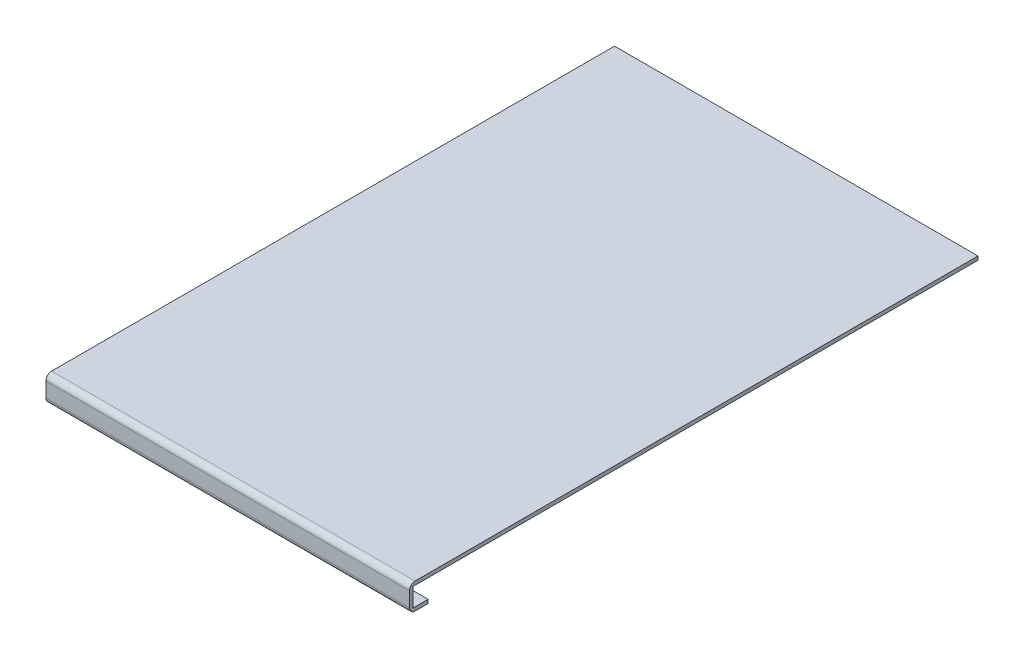
ISO-10303-21;
HEADER;
FILE_DESCRIPTION(('STEP AP214'),'2;1');
FILE_NAME('part.step','',(''),(''),'','','');
FILE_SCHEMA(('AUTOMOTIVE_DESIGN { 1 0 10303 214 1 1 1 1 }'));
ENDSEC;
DATA;
#1=APPLICATION_CONTEXT('core data for automotive mechanical design processes');
#2=APPLICATION_PROTOCOL_DEFINITION('international standard','automotive_design',2000,#1);
#3=PRODUCT_CONTEXT('',#1,'mechanical');
#4=PRODUCT('Part','Part','',(#3));
#5=PRODUCT_RELATED_PRODUCT_CATEGORY('part','',(#4));
#6=PRODUCT_DEFINITION_FORMATION('','',#4);
#7=PRODUCT_DEFINITION_CONTEXT('part definition',#1,'design');
#8=PRODUCT_DEFINITION('design','',#6,#7);
#9=PRODUCT_DEFINITION_SHAPE('','',#8);
#10=(LENGTH_UNIT() NAMED_UNIT(*) SI_UNIT(.MILLI.,.METRE.));
#11=(NAMED_UNIT(*) PLANE_ANGLE_UNIT() SI_UNIT($,.RADIAN.));
#12=(NAMED_UNIT(*) SI_UNIT($,.STERADIAN.) SOLID_ANGLE_UNIT());
#13=UNCERTAINTY_MEASURE_WITH_UNIT(LENGTH_MEASURE(1.E-05),#10,'distance_accuracy_value','');
#14=(GEOMETRIC_REPRESENTATION_CONTEXT(3) GLOBAL_UNCERTAINTY_ASSIGNED_CONTEXT((#13)) GLOBAL_UNIT_ASSIGNED_CONTEXT((#10,
#11,#12)) REPRESENTATION_CONTEXT('',''));
#15=CARTESIAN_POINT('',(0.,0.,0.));
#16=DIRECTION('',(0.,0.,1.));
#17=DIRECTION('',(1.,0.,0.));
#18=AXIS2_PLACEMENT_3D('',#15,#16,#17);
#19=CARTESIAN_POINT('',(157.5,0.,-153.));
#20=DIRECTION('',(0.768221279597377,-0.640184399664479,0.));
#21=DIRECTION('',(0.640184399664479,0.768221279597377,0.));
#22=AXIS2_PLACEMENT_3D('',#19,#20,#21);
#23=PLANE('',#22);
#24=DIRECTION('',(-0.640184399664479,-0.768221279597377,0.));
#25=VECTOR('',#24,1.);
#26=CARTESIAN_POINT('',(157.5,0.,-155.));
#27=LINE('',#26,#25);
#28=CARTESIAN_POINT('',(157.5,0.,-155.));
#29=VERTEX_POINT('',#28);
#30=CARTESIAN_POINT('',(147.5,-12.,-155.));
#31=VERTEX_POINT('',#30);
#32=EDGE_CURVE('E107',#29,#31,#27,.T.);
#33=ORIENTED_EDGE('',*,*,#32,.F.);
#34=DIRECTION('',(0.,0.,-1.));
#35=VECTOR('',#34,1.);
#36=CARTESIAN_POINT('',(157.5,0.,-153.));
#37=LINE('',#36,#35);
#38=CARTESIAN_POINT('',(157.5,0.,-153.));
#39=VERTEX_POINT('',#38);
#40=EDGE_CURVE('E12',#39,#29,#37,.T.);
#41=ORIENTED_EDGE('',*,*,#40,.F.);
#42=DIRECTION('',(-0.640184399664479,-0.768221279597377,0.));
#43=VECTOR('',#42,1.);
#44=CARTESIAN_POINT('',(157.5,0.,-153.));
#45=LINE('',#44,#43);
#46=CARTESIAN_POINT('',(147.5,-12.,-153.));
#47=VERTEX_POINT('',#46);
#48=EDGE_CURVE('E101',#39,#47,#45,.T.);
#49=ORIENTED_EDGE('',*,*,#48,.T.);
#50=DIRECTION('',(0.,0.,-1.));
#51=VECTOR('',#50,1.);
#52=CARTESIAN_POINT('',(147.5,-12.,-153.));
#53=LINE('',#52,#51);
#54=EDGE_CURVE('E46',#47,#31,#53,.T.);
#55=ORIENTED_EDGE('',*,*,#54,.T.);
#56=EDGE_LOOP('',(#33,#41,#49,#55));
#57=FACE_BOUND('',#56,.T.);
#58=ADVANCED_FACE('F43',(#57),#23,.T.);
#59=CARTESIAN_POINT('',(37.5,0.,-153.));
#60=DIRECTION('',(0.,1.,0.));
#61=DIRECTION('',(0.,0.,1.));
#62=AXIS2_PLACEMENT_3D('',#59,#60,#61);
#63=PLANE('',#62);
#64=DIRECTION('',(1.,0.,0.));
#65=VECTOR('',#64,1.);
#66=CARTESIAN_POINT('',(37.5,0.,-155.));
#67=LINE('',#66,#65);
#68=CARTESIAN_POINT('',(37.5,0.,-155.));
#69=VERTEX_POINT('',#68);
#70=EDGE_CURVE('E103',#69,#29,#67,.T.);
#71=ORIENTED_EDGE('',*,*,#70,.F.);
#72=DIRECTION('',(0.,0.,-1.));
#73=VECTOR('',#72,1.);
#74=CARTESIAN_POINT('',(37.5,0.,-153.));
#75=LINE('',#74,#73);
#76=CARTESIAN_POINT('',(37.5,0.,-153.));
#77=VERTEX_POINT('',#76);
#78=EDGE_CURVE('E52',#77,#69,#75,.T.);
#79=ORIENTED_EDGE('',*,*,#78,.F.);
#80=DIRECTION('',(1.,0.,0.));
#81=VECTOR('',#80,1.);
#82=CARTESIAN_POINT('',(37.5,0.,-153.));
#83=LINE('',#82,#81);
#84=EDGE_CURVE('E98',#77,#39,#83,.T.);
#85=ORIENTED_EDGE('',*,*,#84,.T.);
#86=ORIENTED_EDGE('',*,*,#40,.T.);
#87=EDGE_LOOP('',(#71,#79,#85,#86));
#88=FACE_BOUND('',#87,.T.);
#89=ADVANCED_FACE('F117',(#88),#63,.T.);
#90=CARTESIAN_POINT('',(37.5,0.,-153.));
#91=DIRECTION('',(-0.768221279597377,-0.640184399664479,0.));
#92=DIRECTION('',(0.640184399664479,-0.768221279597377,0.));
#93=AXIS2_PLACEMENT_3D('',#90,#91,#92);
#94=PLANE('',#93);
#95=DIRECTION('',(-0.640184399664479,0.768221279597377,0.));
#96=VECTOR('',#95,1.);
#97=CARTESIAN_POINT('',(37.5,0.,-155.));
#98=LINE('',#97,#96);
#99=CARTESIAN_POINT('',(47.5,-12.,-155.));
#100=VERTEX_POINT('',#99);
#101=EDGE_CURVE('E93',#100,#69,#98,.T.);
#102=ORIENTED_EDGE('',*,*,#101,.F.);
#103=DIRECTION('',(0.,0.,-1.));
#104=VECTOR('',#103,1.);
#105=CARTESIAN_POINT('',(47.5,-12.,-153.));
#106=LINE('',#105,#104);
#107=CARTESIAN_POINT('',(47.5,-12.,-153.));
#108=VERTEX_POINT('',#107);
#109=EDGE_CURVE('E88',#108,#100,#106,.T.);
#110=ORIENTED_EDGE('',*,*,#109,.F.);
#111=DIRECTION('',(-0.640184399664479,0.768221279597377,0.));
#112=VECTOR('',#111,1.);
#113=CARTESIAN_POINT('',(37.5,0.,-153.));
#114=LINE('',#113,#112);
#115=EDGE_CURVE('E91',#108,#77,#114,.T.);
#116=ORIENTED_EDGE('',*,*,#115,.T.);
#117=ORIENTED_EDGE('',*,*,#78,.T.);
#118=EDGE_LOOP('',(#102,#110,#116,#117));
#119=FACE_BOUND('',#118,.T.);
#120=ADVANCED_FACE('F90',(#119),#94,.T.);
#121=CARTESIAN_POINT('',(147.5,-12.,-153.));
#122=DIRECTION('',(0.,-1.,0.));
#123=DIRECTION('',(0.,0.,-1.));
#124=AXIS2_PLACEMENT_3D('',#121,#122,#123);
#125=PLANE('',#124);
#126=DIRECTION('',(-1.,0.,0.));
#127=VECTOR('',#126,1.);
#128=CARTESIAN_POINT('',(147.5,-12.,-155.));
#129=LINE('',#128,#127);
#130=EDGE_CURVE('E110',#31,#100,#129,.T.);
#131=ORIENTED_EDGE('',*,*,#130,.F.);
#132=ORIENTED_EDGE('',*,*,#54,.F.);
#133=DIRECTION('',(-1.,0.,0.));
#134=VECTOR('',#133,1.);
#135=CARTESIAN_POINT('',(147.5,-12.,-153.));
#136=LINE('',#135,#134);
#137=EDGE_CURVE('E97',#47,#108,#136,.T.);
#138=ORIENTED_EDGE('',*,*,#137,.T.);
#139=ORIENTED_EDGE('',*,*,#109,.T.);
#140=EDGE_LOOP('',(#131,#132,#138,#139));
#141=FACE_BOUND('',#140,.T.);
#142=ADVANCED_FACE('F100',(#141),#125,.T.);
#143=CARTESIAN_POINT('',(0.,0.,-153.));
#144=DIRECTION('',(0.,0.,1.));
#145=DIRECTION('',(1.,0.,0.));
#146=AXIS2_PLACEMENT_3D('',#143,#144,#145);
#147=PLANE('',#146);
#148=ORIENTED_EDGE('',*,*,#48,.F.);
#149=ORIENTED_EDGE('',*,*,#84,.F.);
#150=ORIENTED_EDGE('',*,*,#115,.F.);
#151=ORIENTED_EDGE('',*,*,#137,.F.);
#152=EDGE_LOOP('',(#148,#149,#150,#151));
#153=FACE_BOUND('',#152,.T.);
#154=ADVANCED_FACE('F96',(#153),#147,.T.);
#155=CARTESIAN_POINT('',(0.,0.,-155.));
#156=DIRECTION('',(0.,0.,1.));
#157=DIRECTION('',(1.,0.,0.));
#158=AXIS2_PLACEMENT_3D('',#155,#156,#157);
#159=PLANE('',#158);
#160=ORIENTED_EDGE('',*,*,#32,.T.);
#161=ORIENTED_EDGE('',*,*,#130,.T.);
#162=ORIENTED_EDGE('',*,*,#101,.T.);
#163=ORIENTED_EDGE('',*,*,#70,.T.);
#164=EDGE_LOOP('',(#160,#161,#162,#163));
#165=FACE_BOUND('',#164,.T.);
#166=ADVANCED_FACE('F116',(#165),#159,.F.);
#167=CLOSED_SHELL('',(#58,#89,#120,#142,#154,#166));
#168=MANIFOLD_SOLID_BREP('B2',#167);
#169=CARTESIAN_POINT('',(195.,0.,0.));
#170=DIRECTION('',(0.,-1.,0.));
#171=DIRECTION('',(0.,0.,-1.));
#172=AXIS2_PLACEMENT_3D('',#169,#170,#171);
#173=PLANE('',#172);
#174=DIRECTION('',(0.,0.,1.));
#175=VECTOR('',#174,1.);
#176=CARTESIAN_POINT('',(0.,0.,0.));
#177=LINE('',#176,#175);
#178=CARTESIAN_POINT('',(0.,0.,-155.));
#179=VERTEX_POINT('',#178);
#180=CARTESIAN_POINT('',(0.,0.,147.));
#181=VERTEX_POINT('',#180);
#182=EDGE_CURVE('E282',#179,#181,#177,.T.);
#183=ORIENTED_EDGE('',*,*,#182,.T.);
#184=DIRECTION('',(-1.,0.,0.));
#185=VECTOR('',#184,1.);
#186=CARTESIAN_POINT('',(195.,0.,147.));
#187=LINE('',#186,#185);
#188=CARTESIAN_POINT('',(195.,0.,147.));
#189=VERTEX_POINT('',#188);
#190=EDGE_CURVE('E41',#181,#189,#187,.F.);
#191=ORIENTED_EDGE('',*,*,#190,.T.);
#192=DIRECTION('',(0.,0.,1.));
#193=VECTOR('',#192,1.);
#194=CARTESIAN_POINT('',(195.,0.,0.));
#195=LINE('',#194,#193);
#196=CARTESIAN_POINT('',(195.,0.,-155.));
#197=VERTEX_POINT('',#196);
#198=EDGE_CURVE('E299',#197,#189,#195,.T.);
#199=ORIENTED_EDGE('',*,*,#198,.F.);
#200=DIRECTION('',(-1.,0.,0.));
#201=VECTOR('',#200,1.);
#202=CARTESIAN_POINT('',(195.,0.,-155.));
#203=LINE('',#202,#201);
#204=EDGE_CURVE('E281',#197,#179,#203,.T.);
#205=ORIENTED_EDGE('',*,*,#204,.T.);
#206=EDGE_LOOP('',(#183,#191,#199,#205));
#207=FACE_BOUND('',#206,.T.);
#208=ADVANCED_FACE('F167',(#207),#173,.F.);
#209=CARTESIAN_POINT('',(195.,0.,150.));
#210=DIRECTION('',(0.,0.,-1.));
#211=DIRECTION('',(-1.,0.,0.));
#212=AXIS2_PLACEMENT_3D('',#209,#210,#211);
#213=PLANE('',#212);
#214=DIRECTION('',(0.,-1.,0.));
#215=VECTOR('',#214,1.);
#216=CARTESIAN_POINT('',(0.,0.,150.));
#217=LINE('',#216,#215);
#218=CARTESIAN_POINT('',(0.,-3.00000000000002,150.));
#219=VERTEX_POINT('',#218);
#220=CARTESIAN_POINT('',(0.,-11.,150.));
#221=VERTEX_POINT('',#220);
#222=EDGE_CURVE('E284',#219,#221,#217,.T.);
#223=ORIENTED_EDGE('',*,*,#222,.T.);
#224=DIRECTION('',(-1.,0.,0.));
#225=VECTOR('',#224,1.);
#226=CARTESIAN_POINT('',(195.,-11.,150.));
#227=LINE('',#226,#225);
#228=CARTESIAN_POINT('',(195.,-11.,150.));
#229=VERTEX_POINT('',#228);
#230=EDGE_CURVE('E188',#221,#229,#227,.F.);
#231=ORIENTED_EDGE('',*,*,#230,.T.);
#232=DIRECTION('',(0.,-1.,0.));
#233=VECTOR('',#232,1.);
#234=CARTESIAN_POINT('',(195.,0.,150.));
#235=LINE('',#234,#233);
#236=CARTESIAN_POINT('',(195.,-3.00000000000002,150.));
#237=VERTEX_POINT('',#236);
#238=EDGE_CURVE('E255',#237,#229,#235,.T.);
#239=ORIENTED_EDGE('',*,*,#238,.F.);
#240=DIRECTION('',(-1.,0.,0.));
#241=VECTOR('',#240,1.);
#242=CARTESIAN_POINT('',(195.,-3.00000000000002,150.));
#243=LINE('',#242,#241);
#244=EDGE_CURVE('E317',#237,#219,#243,.T.);
#245=ORIENTED_EDGE('',*,*,#244,.T.);
#246=EDGE_LOOP('',(#223,#231,#239,#245));
#247=FACE_BOUND('',#246,.T.);
#248=ADVANCED_FACE('F325',(#247),#213,.F.);
#249=CARTESIAN_POINT('',(195.,-14.,150.));
#250=DIRECTION('',(0.,1.,0.));
#251=DIRECTION('',(0.,0.,1.));
#252=AXIS2_PLACEMENT_3D('',#249,#250,#251);
#253=PLANE('',#252);
#254=DIRECTION('',(0.,0.,-1.));
#255=VECTOR('',#254,1.);
#256=CARTESIAN_POINT('',(195.,-14.,150.));
#257=LINE('',#256,#255);
#258=CARTESIAN_POINT('',(195.,-14.,147.));
#259=VERTEX_POINT('',#258);
#260=CARTESIAN_POINT('',(195.,-14.,140.));
#261=VERTEX_POINT('',#260);
#262=EDGE_CURVE('E245',#259,#261,#257,.T.);
#263=ORIENTED_EDGE('',*,*,#262,.F.);
#264=DIRECTION('',(-1.,0.,0.));
#265=VECTOR('',#264,1.);
#266=CARTESIAN_POINT('',(195.,-14.,147.));
#267=LINE('',#266,#265);
#268=CARTESIAN_POINT('',(0.,-14.,147.));
#269=VERTEX_POINT('',#268);
#270=EDGE_CURVE('E264',#259,#269,#267,.T.);
#271=ORIENTED_EDGE('',*,*,#270,.T.);
#272=DIRECTION('',(0.,0.,-1.));
#273=VECTOR('',#272,1.);
#274=CARTESIAN_POINT('',(0.,-14.,150.));
#275=LINE('',#274,#273);
#276=CARTESIAN_POINT('',(0.,-14.,140.));
#277=VERTEX_POINT('',#276);
#278=EDGE_CURVE('E261',#269,#277,#275,.T.);
#279=ORIENTED_EDGE('',*,*,#278,.T.);
#280=DIRECTION('',(-1.,0.,0.));
#281=VECTOR('',#280,1.);
#282=CARTESIAN_POINT('',(195.,-14.,140.));
#283=LINE('',#282,#281);
#284=EDGE_CURVE('E258',#261,#277,#283,.T.);
#285=ORIENTED_EDGE('',*,*,#284,.F.);
#286=EDGE_LOOP('',(#263,#271,#279,#285));
#287=FACE_BOUND('',#286,.T.);
#288=ADVANCED_FACE('F259',(#287),#253,.F.);
#289=CARTESIAN_POINT('',(195.,-12.,140.));
#290=DIRECTION('',(0.,0.,1.));
#291=DIRECTION('',(1.,0.,0.));
#292=AXIS2_PLACEMENT_3D('',#289,#290,#291);
#293=PLANE('',#292);
#294=DIRECTION('',(0.,1.,0.));
#295=VECTOR('',#294,1.);
#296=CARTESIAN_POINT('',(0.,-12.,140.));
#297=LINE('',#296,#295);
#298=CARTESIAN_POINT('',(0.,-12.,140.));
#299=VERTEX_POINT('',#298);
#300=EDGE_CURVE('E287',#277,#299,#297,.T.);
#301=ORIENTED_EDGE('',*,*,#300,.T.);
#302=DIRECTION('',(-1.,0.,0.));
#303=VECTOR('',#302,1.);
#304=CARTESIAN_POINT('',(195.,-12.,140.));
#305=LINE('',#304,#303);
#306=CARTESIAN_POINT('',(195.,-12.,140.));
#307=VERTEX_POINT('',#306);
#308=EDGE_CURVE('E265',#307,#299,#305,.T.);
#309=ORIENTED_EDGE('',*,*,#308,.F.);
#310=DIRECTION('',(0.,1.,0.));
#311=VECTOR('',#310,1.);
#312=CARTESIAN_POINT('',(195.,-12.,140.));
#313=LINE('',#312,#311);
#314=EDGE_CURVE('E249',#261,#307,#313,.T.);
#315=ORIENTED_EDGE('',*,*,#314,.F.);
#316=ORIENTED_EDGE('',*,*,#284,.T.);
#317=EDGE_LOOP('',(#301,#309,#315,#316));
#318=FACE_BOUND('',#317,.T.);
#319=ADVANCED_FACE('F267',(#318),#293,.F.);
#320=CARTESIAN_POINT('',(195.,-12.,148.));
#321=DIRECTION('',(0.,-1.,0.));
#322=DIRECTION('',(0.,0.,-1.));
#323=AXIS2_PLACEMENT_3D('',#320,#321,#322);
#324=PLANE('',#323);
#325=DIRECTION('',(0.,0.,1.));
#326=VECTOR('',#325,1.);
#327=CARTESIAN_POINT('',(0.,-12.,148.));
#328=LINE('',#327,#326);
#329=CARTESIAN_POINT('',(0.,-12.,148.));
#330=VERTEX_POINT('',#329);
#331=EDGE_CURVE('E289',#299,#330,#328,.T.);
#332=ORIENTED_EDGE('',*,*,#331,.T.);
#333=DIRECTION('',(-1.,0.,0.));
#334=VECTOR('',#333,1.);
#335=CARTESIAN_POINT('',(195.,-12.,148.));
#336=LINE('',#335,#334);
#337=CARTESIAN_POINT('',(195.,-12.,148.));
#338=VERTEX_POINT('',#337);
#339=EDGE_CURVE('E308',#338,#330,#336,.T.);
#340=ORIENTED_EDGE('',*,*,#339,.F.);
#341=DIRECTION('',(0.,0.,1.));
#342=VECTOR('',#341,1.);
#343=CARTESIAN_POINT('',(195.,-12.,148.));
#344=LINE('',#343,#342);
#345=EDGE_CURVE('E270',#307,#338,#344,.T.);
#346=ORIENTED_EDGE('',*,*,#345,.F.);
#347=ORIENTED_EDGE('',*,*,#308,.T.);
#348=EDGE_LOOP('',(#332,#340,#346,#347));
#349=FACE_BOUND('',#348,.T.);
#350=ADVANCED_FACE('F346',(#349),#324,.F.);
#351=CARTESIAN_POINT('',(195.,-12.,148.));
#352=DIRECTION('',(0.,0.,1.));
#353=DIRECTION('',(1.,0.,0.));
#354=AXIS2_PLACEMENT_3D('',#351,#352,#353);
#355=PLANE('',#354);
#356=DIRECTION('',(0.,1.,0.));
#357=VECTOR('',#356,1.);
#358=CARTESIAN_POINT('',(0.,-12.,148.));
#359=LINE('',#358,#357);
#360=CARTESIAN_POINT('',(0.,-2.00000000000001,148.));
#361=VERTEX_POINT('',#360);
#362=EDGE_CURVE('E291',#330,#361,#359,.T.);
#363=ORIENTED_EDGE('',*,*,#362,.T.);
#364=DIRECTION('',(-1.,0.,0.));
#365=VECTOR('',#364,1.);
#366=CARTESIAN_POINT('',(195.,-2.00000000000001,148.));
#367=LINE('',#366,#365);
#368=CARTESIAN_POINT('',(195.,-2.00000000000001,148.));
#369=VERTEX_POINT('',#368);
#370=EDGE_CURVE('E305',#369,#361,#367,.T.);
#371=ORIENTED_EDGE('',*,*,#370,.F.);
#372=DIRECTION('',(0.,1.,0.));
#373=VECTOR('',#372,1.);
#374=CARTESIAN_POINT('',(195.,-12.,148.));
#375=LINE('',#374,#373);
#376=EDGE_CURVE('E272',#338,#369,#375,.T.);
#377=ORIENTED_EDGE('',*,*,#376,.F.);
#378=ORIENTED_EDGE('',*,*,#339,.T.);
#379=EDGE_LOOP('',(#363,#371,#377,#378));
#380=FACE_BOUND('',#379,.T.);
#381=ADVANCED_FACE('F340',(#380),#355,.F.);
#382=CARTESIAN_POINT('',(195.,-2.00000000000002,-155.));
#383=DIRECTION('',(0.,1.,0.));
#384=DIRECTION('',(0.,0.,1.));
#385=AXIS2_PLACEMENT_3D('',#382,#383,#384);
#386=PLANE('',#385);
#387=DIRECTION('',(0.,0.,-1.));
#388=VECTOR('',#387,1.);
#389=CARTESIAN_POINT('',(0.,-2.00000000000002,-155.));
#390=LINE('',#389,#388);
#391=CARTESIAN_POINT('',(0.,-2.00000000000002,-155.));
#392=VERTEX_POINT('',#391);
#393=EDGE_CURVE('E294',#361,#392,#390,.T.);
#394=ORIENTED_EDGE('',*,*,#393,.T.);
#395=DIRECTION('',(-1.,0.,0.));
#396=VECTOR('',#395,1.);
#397=CARTESIAN_POINT('',(195.,-2.00000000000002,-155.));
#398=LINE('',#397,#396);
#399=CARTESIAN_POINT('',(195.,-2.00000000000002,-155.));
#400=VERTEX_POINT('',#399);
#401=EDGE_CURVE('E302',#400,#392,#398,.T.);
#402=ORIENTED_EDGE('',*,*,#401,.F.);
#403=DIRECTION('',(0.,0.,-1.));
#404=VECTOR('',#403,1.);
#405=CARTESIAN_POINT('',(195.,-2.00000000000001,148.));
#406=LINE('',#405,#404);
#407=EDGE_CURVE('E277',#369,#400,#406,.T.);
#408=ORIENTED_EDGE('',*,*,#407,.F.);
#409=ORIENTED_EDGE('',*,*,#370,.T.);
#410=EDGE_LOOP('',(#394,#402,#408,#409));
#411=FACE_BOUND('',#410,.T.);
#412=ADVANCED_FACE('F344',(#411),#386,.F.);
#413=CARTESIAN_POINT('',(195.,0.,-155.));
#414=DIRECTION('',(0.,0.,1.));
#415=DIRECTION('',(1.,0.,0.));
#416=AXIS2_PLACEMENT_3D('',#413,#414,#415);
#417=PLANE('',#416);
#418=DIRECTION('',(0.,1.,0.));
#419=VECTOR('',#418,1.);
#420=CARTESIAN_POINT('',(0.,0.,-155.));
#421=LINE('',#420,#419);
#422=EDGE_CURVE('E296',#392,#179,#421,.T.);
#423=ORIENTED_EDGE('',*,*,#422,.T.);
#424=ORIENTED_EDGE('',*,*,#204,.F.);
#425=DIRECTION('',(0.,1.,0.));
#426=VECTOR('',#425,1.);
#427=CARTESIAN_POINT('',(195.,0.,-155.));
#428=LINE('',#427,#426);
#429=EDGE_CURVE('E279',#400,#197,#428,.T.);
#430=ORIENTED_EDGE('',*,*,#429,.F.);
#431=ORIENTED_EDGE('',*,*,#401,.T.);
#432=EDGE_LOOP('',(#423,#424,#430,#431));
#433=FACE_BOUND('',#432,.T.);
#434=ADVANCED_FACE('F333',(#433),#417,.F.);
#435=CARTESIAN_POINT('',(195.,0.,0.));
#436=DIRECTION('',(-1.,0.,0.));
#437=DIRECTION('',(0.,0.,1.));
#438=AXIS2_PLACEMENT_3D('',#435,#436,#437);
#439=PLANE('',#438);
#440=ORIENTED_EDGE('',*,*,#238,.T.);
#441=CARTESIAN_POINT('',(195.,-11.,147.));
#442=DIRECTION('',(-1.,0.,0.));
#443=DIRECTION('',(0.,0.,1.));
#444=AXIS2_PLACEMENT_3D('',#441,#442,#443);
#445=CIRCLE('',#444,3.);
#446=EDGE_CURVE('E175',#229,#259,#445,.F.);
#447=ORIENTED_EDGE('',*,*,#446,.T.);
#448=ORIENTED_EDGE('',*,*,#262,.T.);
#449=ORIENTED_EDGE('',*,*,#314,.T.);
#450=ORIENTED_EDGE('',*,*,#345,.T.);
#451=ORIENTED_EDGE('',*,*,#376,.T.);
#452=ORIENTED_EDGE('',*,*,#407,.T.);
#453=ORIENTED_EDGE('',*,*,#429,.T.);
#454=ORIENTED_EDGE('',*,*,#198,.T.);
#455=CARTESIAN_POINT('',(195.,-3.00000000000002,147.));
#456=DIRECTION('',(-1.,0.,0.));
#457=DIRECTION('',(0.,0.,1.));
#458=AXIS2_PLACEMENT_3D('',#455,#456,#457);
#459=CIRCLE('',#458,3.);
#460=EDGE_CURVE('E321',#189,#237,#459,.F.);
#461=ORIENTED_EDGE('',*,*,#460,.T.);
#462=EDGE_LOOP('',(#440,#447,#448,#449,#450,#451,#452,#453,#454,#461));
#463=FACE_BOUND('',#462,.T.);
#464=ADVANCED_FACE('F247',(#463),#439,.F.);
#465=CARTESIAN_POINT('',(0.,0.,0.));
#466=DIRECTION('',(-1.,0.,0.));
#467=DIRECTION('',(0.,0.,1.));
#468=AXIS2_PLACEMENT_3D('',#465,#466,#467);
#469=PLANE('',#468);
#470=ORIENTED_EDGE('',*,*,#278,.F.);
#471=CARTESIAN_POINT('',(0.,-11.,147.));
#472=DIRECTION('',(-1.,0.,0.));
#473=DIRECTION('',(0.,0.,1.));
#474=AXIS2_PLACEMENT_3D('',#471,#472,#473);
#475=CIRCLE('',#474,3.);
#476=EDGE_CURVE('E315',#269,#221,#475,.T.);
#477=ORIENTED_EDGE('',*,*,#476,.T.);
#478=ORIENTED_EDGE('',*,*,#222,.F.);
#479=CARTESIAN_POINT('',(0.,-3.00000000000002,147.));
#480=DIRECTION('',(-1.,0.,0.));
#481=DIRECTION('',(0.,0.,1.));
#482=AXIS2_PLACEMENT_3D('',#479,#480,#481);
#483=CIRCLE('',#482,3.);
#484=EDGE_CURVE('E313',#219,#181,#483,.T.);
#485=ORIENTED_EDGE('',*,*,#484,.T.);
#486=ORIENTED_EDGE('',*,*,#182,.F.);
#487=ORIENTED_EDGE('',*,*,#422,.F.);
#488=ORIENTED_EDGE('',*,*,#393,.F.);
#489=ORIENTED_EDGE('',*,*,#362,.F.);
#490=ORIENTED_EDGE('',*,*,#331,.F.);
#491=ORIENTED_EDGE('',*,*,#300,.F.);
#492=EDGE_LOOP('',(#470,#477,#478,#485,#486,#487,#488,#489,#490,#491));
#493=FACE_BOUND('',#492,.T.);
#494=ADVANCED_FACE('F328',(#493),#469,.T.);
#495=CARTESIAN_POINT('',(195.,-11.,147.));
#496=DIRECTION('',(-1.,0.,0.));
#497=DIRECTION('',(0.,0.,1.));
#498=AXIS2_PLACEMENT_3D('',#495,#496,#497);
#499=CYLINDRICAL_SURFACE('',#498,3.);
#500=ORIENTED_EDGE('',*,*,#446,.F.);
#501=ORIENTED_EDGE('',*,*,#230,.F.);
#502=ORIENTED_EDGE('',*,*,#476,.F.);
#503=ORIENTED_EDGE('',*,*,#270,.F.);
#504=EDGE_LOOP('',(#500,#501,#502,#503));
#505=FACE_BOUND('',#504,.T.);
#506=ADVANCED_FACE('F348',(#505),#499,.T.);
#507=CARTESIAN_POINT('',(195.,-3.00000000000002,147.));
#508=DIRECTION('',(-1.,0.,0.));
#509=DIRECTION('',(0.,0.,1.));
#510=AXIS2_PLACEMENT_3D('',#507,#508,#509);
#511=CYLINDRICAL_SURFACE('',#510,3.);
#512=ORIENTED_EDGE('',*,*,#460,.F.);
#513=ORIENTED_EDGE('',*,*,#190,.F.);
#514=ORIENTED_EDGE('',*,*,#484,.F.);
#515=ORIENTED_EDGE('',*,*,#244,.F.);
#516=EDGE_LOOP('',(#512,#513,#514,#515));
#517=FACE_BOUND('',#516,.T.);
#518=ADVANCED_FACE('F169',(#517),#511,.T.);
#519=CLOSED_SHELL('',(#208,#248,#288,#319,#350,#381,#412,#434,#464,#494,#506,#518));
#520=MANIFOLD_SOLID_BREP('B6',#519);
#521=ADVANCED_BREP_SHAPE_REPRESENTATION('',(#18,#168,#520),#14);
#522=SHAPE_DEFINITION_REPRESENTATION(#9,#521);
ENDSEC;
END-ISO-10303-21;
